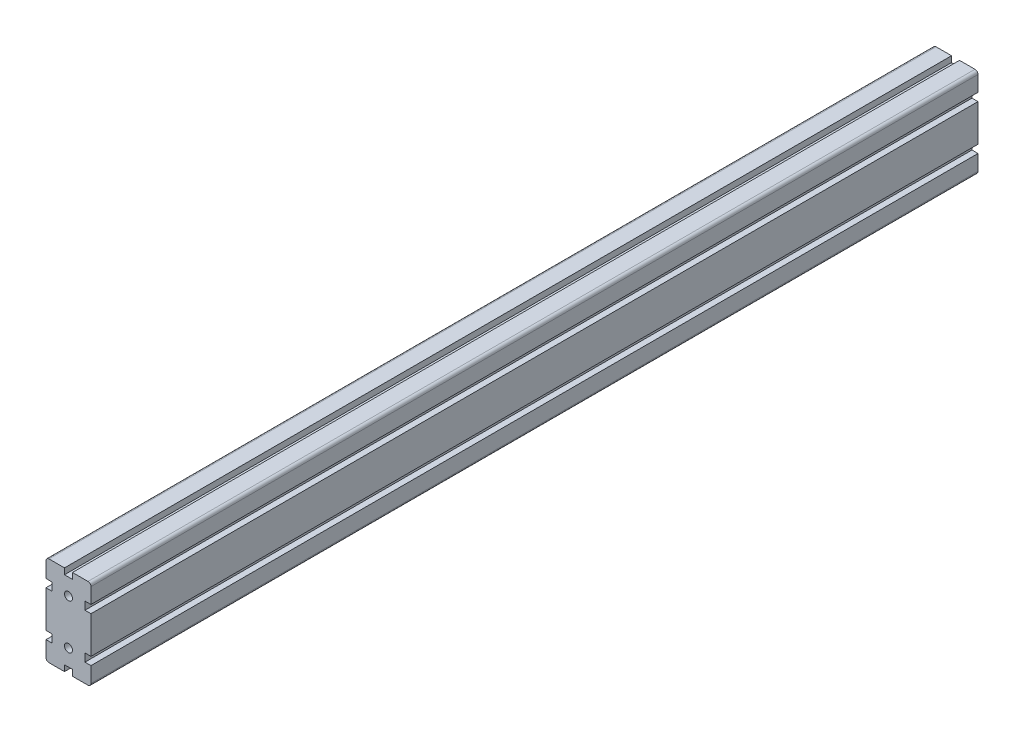
ISO-10303-21;
HEADER;
FILE_DESCRIPTION(('STEP AP214'),'2;1');
FILE_NAME('part.step','',(''),(''),'','','');
FILE_SCHEMA(('AUTOMOTIVE_DESIGN { 1 0 10303 214 1 1 1 1 }'));
ENDSEC;
DATA;
#1=APPLICATION_CONTEXT('core data for automotive mechanical design processes');
#2=APPLICATION_PROTOCOL_DEFINITION('international standard','automotive_design',2000,#1);
#3=PRODUCT_CONTEXT('',#1,'mechanical');
#4=PRODUCT('Part','Part','',(#3));
#5=PRODUCT_RELATED_PRODUCT_CATEGORY('part','',(#4));
#6=PRODUCT_DEFINITION_FORMATION('','',#4);
#7=PRODUCT_DEFINITION_CONTEXT('part definition',#1,'design');
#8=PRODUCT_DEFINITION('design','',#6,#7);
#9=PRODUCT_DEFINITION_SHAPE('','',#8);
#10=(LENGTH_UNIT() NAMED_UNIT(*) SI_UNIT(.MILLI.,.METRE.));
#11=(NAMED_UNIT(*) PLANE_ANGLE_UNIT() SI_UNIT($,.RADIAN.));
#12=(NAMED_UNIT(*) SI_UNIT($,.STERADIAN.) SOLID_ANGLE_UNIT());
#13=UNCERTAINTY_MEASURE_WITH_UNIT(LENGTH_MEASURE(1.E-05),#10,'distance_accuracy_value','');
#14=(GEOMETRIC_REPRESENTATION_CONTEXT(3) GLOBAL_UNCERTAINTY_ASSIGNED_CONTEXT((#13)) GLOBAL_UNIT_ASSIGNED_CONTEXT((#10,
#11,#12)) REPRESENTATION_CONTEXT('',''));
#15=CARTESIAN_POINT('',(0.,0.,0.));
#16=DIRECTION('',(0.,0.,1.));
#17=DIRECTION('',(1.,0.,0.));
#18=AXIS2_PLACEMENT_3D('',#15,#16,#17);
#19=CARTESIAN_POINT('',(-16.5000000000001,26.5,-112.));
#20=DIRECTION('',(-1.,0.,0.));
#21=DIRECTION('',(0.,0.,1.));
#22=AXIS2_PLACEMENT_3D('',#19,#20,#21);
#23=PLANE('',#22);
#24=DIRECTION('',(0.,1.,0.));
#25=VECTOR('',#24,1.);
#26=CARTESIAN_POINT('',(-16.5000000000001,26.5,-1000.));
#27=LINE('',#26,#25);
#28=CARTESIAN_POINT('',(-16.5000000000001,18.5,-1000.));
#29=VERTEX_POINT('',#28);
#30=CARTESIAN_POINT('',(-16.5000000000001,26.5,-1000.));
#31=VERTEX_POINT('',#30);
#32=EDGE_CURVE('E274',#29,#31,#27,.T.);
#33=ORIENTED_EDGE('',*,*,#32,.F.);
#34=DIRECTION('',(0.,0.,-1.));
#35=VECTOR('',#34,1.);
#36=CARTESIAN_POINT('',(-16.5000000000001,18.5,-112.));
#37=LINE('',#36,#35);
#38=CARTESIAN_POINT('',(-16.5000000000001,18.5,-112.));
#39=VERTEX_POINT('',#38);
#40=EDGE_CURVE('E11',#39,#29,#37,.T.);
#41=ORIENTED_EDGE('',*,*,#40,.F.);
#42=DIRECTION('',(0.,1.,0.));
#43=VECTOR('',#42,1.);
#44=CARTESIAN_POINT('',(-16.5000000000001,26.5,-112.));
#45=LINE('',#44,#43);
#46=CARTESIAN_POINT('',(-16.5000000000001,26.5,-112.));
#47=VERTEX_POINT('',#46);
#48=EDGE_CURVE('E367',#39,#47,#45,.T.);
#49=ORIENTED_EDGE('',*,*,#48,.T.);
#50=DIRECTION('',(0.,0.,-1.));
#51=VECTOR('',#50,1.);
#52=CARTESIAN_POINT('',(-16.5000000000001,26.5,-112.));
#53=LINE('',#52,#51);
#54=EDGE_CURVE('E36',#47,#31,#53,.T.);
#55=ORIENTED_EDGE('',*,*,#54,.T.);
#56=EDGE_LOOP('',(#33,#41,#49,#55));
#57=FACE_BOUND('',#56,.T.);
#58=ADVANCED_FACE('F33',(#57),#23,.T.);
#59=CARTESIAN_POINT('',(-22.4999999999999,18.5,-112.));
#60=DIRECTION('',(0.,1.,0.));
#61=DIRECTION('',(0.,0.,1.));
#62=AXIS2_PLACEMENT_3D('',#59,#60,#61);
#63=PLANE('',#62);
#64=DIRECTION('',(1.,0.,0.));
#65=VECTOR('',#64,1.);
#66=CARTESIAN_POINT('',(-22.4999999999999,18.5,-1000.));
#67=LINE('',#66,#65);
#68=CARTESIAN_POINT('',(-22.4999999999999,18.5,-1000.));
#69=VERTEX_POINT('',#68);
#70=EDGE_CURVE('E365',#69,#29,#67,.T.);
#71=ORIENTED_EDGE('',*,*,#70,.F.);
#72=DIRECTION('',(0.,0.,-1.));
#73=VECTOR('',#72,1.);
#74=CARTESIAN_POINT('',(-22.4999999999999,18.5,-112.));
#75=LINE('',#74,#73);
#76=CARTESIAN_POINT('',(-22.4999999999999,18.5,-112.));
#77=VERTEX_POINT('',#76);
#78=EDGE_CURVE('E42',#77,#69,#75,.T.);
#79=ORIENTED_EDGE('',*,*,#78,.F.);
#80=DIRECTION('',(1.,0.,0.));
#81=VECTOR('',#80,1.);
#82=CARTESIAN_POINT('',(-22.4999999999999,18.5,-112.));
#83=LINE('',#82,#81);
#84=EDGE_CURVE('E264',#77,#39,#83,.T.);
#85=ORIENTED_EDGE('',*,*,#84,.T.);
#86=ORIENTED_EDGE('',*,*,#40,.T.);
#87=EDGE_LOOP('',(#71,#79,#85,#86));
#88=FACE_BOUND('',#87,.T.);
#89=ADVANCED_FACE('F427',(#88),#63,.T.);
#90=CARTESIAN_POINT('',(-22.4999999999999,-18.5,-112.));
#91=DIRECTION('',(-1.,0.,0.));
#92=DIRECTION('',(0.,0.,1.));
#93=AXIS2_PLACEMENT_3D('',#90,#91,#92);
#94=PLANE('',#93);
#95=DIRECTION('',(0.,1.,0.));
#96=VECTOR('',#95,1.);
#97=CARTESIAN_POINT('',(-22.4999999999999,-18.5,-1000.));
#98=LINE('',#97,#96);
#99=CARTESIAN_POINT('',(-22.4999999999999,-18.5,-1000.));
#100=VERTEX_POINT('',#99);
#101=EDGE_CURVE('E251',#100,#69,#98,.T.);
#102=ORIENTED_EDGE('',*,*,#101,.F.);
#103=DIRECTION('',(0.,0.,-1.));
#104=VECTOR('',#103,1.);
#105=CARTESIAN_POINT('',(-22.4999999999999,-18.5,-112.));
#106=LINE('',#105,#104);
#107=CARTESIAN_POINT('',(-22.4999999999999,-18.5,-112.));
#108=VERTEX_POINT('',#107);
#109=EDGE_CURVE('E246',#108,#100,#106,.T.);
#110=ORIENTED_EDGE('',*,*,#109,.F.);
#111=DIRECTION('',(0.,1.,0.));
#112=VECTOR('',#111,1.);
#113=CARTESIAN_POINT('',(-22.4999999999999,-18.5,-112.));
#114=LINE('',#113,#112);
#115=EDGE_CURVE('E249',#108,#77,#114,.T.);
#116=ORIENTED_EDGE('',*,*,#115,.T.);
#117=ORIENTED_EDGE('',*,*,#78,.T.);
#118=EDGE_LOOP('',(#102,#110,#116,#117));
#119=FACE_BOUND('',#118,.T.);
#120=ADVANCED_FACE('F248',(#119),#94,.T.);
#121=CARTESIAN_POINT('',(-16.5000000000011,-18.5,-112.));
#122=DIRECTION('',(0.,-1.,0.));
#123=DIRECTION('',(0.,0.,-1.));
#124=AXIS2_PLACEMENT_3D('',#121,#122,#123);
#125=PLANE('',#124);
#126=DIRECTION('',(-1.,0.,0.));
#127=VECTOR('',#126,1.);
#128=CARTESIAN_POINT('',(-16.5000000000011,-18.5,-1000.));
#129=LINE('',#128,#127);
#130=CARTESIAN_POINT('',(-16.5000000000011,-18.5,-1000.));
#131=VERTEX_POINT('',#130);
#132=EDGE_CURVE('E362',#131,#100,#129,.T.);
#133=ORIENTED_EDGE('',*,*,#132,.F.);
#134=DIRECTION('',(0.,0.,-1.));
#135=VECTOR('',#134,1.);
#136=CARTESIAN_POINT('',(-16.5000000000011,-18.5,-112.));
#137=LINE('',#136,#135);
#138=CARTESIAN_POINT('',(-16.5000000000011,-18.5,-112.));
#139=VERTEX_POINT('',#138);
#140=EDGE_CURVE('E256',#139,#131,#137,.T.);
#141=ORIENTED_EDGE('',*,*,#140,.F.);
#142=DIRECTION('',(-1.,0.,0.));
#143=VECTOR('',#142,1.);
#144=CARTESIAN_POINT('',(-16.5000000000011,-18.5,-112.));
#145=LINE('',#144,#143);
#146=EDGE_CURVE('E262',#139,#108,#145,.T.);
#147=ORIENTED_EDGE('',*,*,#146,.T.);
#148=ORIENTED_EDGE('',*,*,#109,.T.);
#149=EDGE_LOOP('',(#133,#141,#147,#148));
#150=FACE_BOUND('',#149,.T.);
#151=ADVANCED_FACE('F266',(#150),#125,.T.);
#152=CARTESIAN_POINT('',(-16.5000000000011,-18.5,-112.));
#153=DIRECTION('',(-1.,0.,0.));
#154=DIRECTION('',(0.,0.,1.));
#155=AXIS2_PLACEMENT_3D('',#152,#153,#154);
#156=PLANE('',#155);
#157=DIRECTION('',(0.,1.,0.));
#158=VECTOR('',#157,1.);
#159=CARTESIAN_POINT('',(-16.5000000000011,-18.5,-1000.));
#160=LINE('',#159,#158);
#161=CARTESIAN_POINT('',(-16.5000000000011,-26.5,-1000.));
#162=VERTEX_POINT('',#161);
#163=EDGE_CURVE('E359',#162,#131,#160,.T.);
#164=ORIENTED_EDGE('',*,*,#163,.F.);
#165=DIRECTION('',(0.,0.,-1.));
#166=VECTOR('',#165,1.);
#167=CARTESIAN_POINT('',(-16.5000000000011,-26.5,-112.));
#168=LINE('',#167,#166);
#169=CARTESIAN_POINT('',(-16.5000000000011,-26.5,-112.));
#170=VERTEX_POINT('',#169);
#171=EDGE_CURVE('E371',#170,#162,#168,.T.);
#172=ORIENTED_EDGE('',*,*,#171,.F.);
#173=DIRECTION('',(0.,1.,0.));
#174=VECTOR('',#173,1.);
#175=CARTESIAN_POINT('',(-16.5000000000011,-18.5,-112.));
#176=LINE('',#175,#174);
#177=EDGE_CURVE('E267',#170,#139,#176,.T.);
#178=ORIENTED_EDGE('',*,*,#177,.T.);
#179=ORIENTED_EDGE('',*,*,#140,.T.);
#180=EDGE_LOOP('',(#164,#172,#178,#179));
#181=FACE_BOUND('',#180,.T.);
#182=ADVANCED_FACE('F440',(#181),#156,.T.);
#183=CARTESIAN_POINT('',(-22.4999999999999,-26.5,-112.));
#184=DIRECTION('',(0.,1.,0.));
#185=DIRECTION('',(0.,0.,1.));
#186=AXIS2_PLACEMENT_3D('',#183,#184,#185);
#187=PLANE('',#186);
#188=DIRECTION('',(1.,0.,0.));
#189=VECTOR('',#188,1.);
#190=CARTESIAN_POINT('',(-22.4999999999999,-26.5,-1000.));
#191=LINE('',#190,#189);
#192=CARTESIAN_POINT('',(-22.4999999999999,-26.5,-1000.));
#193=VERTEX_POINT('',#192);
#194=EDGE_CURVE('E356',#193,#162,#191,.T.);
#195=ORIENTED_EDGE('',*,*,#194,.F.);
#196=DIRECTION('',(0.,0.,-1.));
#197=VECTOR('',#196,1.);
#198=CARTESIAN_POINT('',(-22.4999999999999,-26.5,-112.));
#199=LINE('',#198,#197);
#200=CARTESIAN_POINT('',(-22.4999999999999,-26.5,-112.));
#201=VERTEX_POINT('',#200);
#202=EDGE_CURVE('E373',#201,#193,#199,.T.);
#203=ORIENTED_EDGE('',*,*,#202,.F.);
#204=DIRECTION('',(1.,0.,0.));
#205=VECTOR('',#204,1.);
#206=CARTESIAN_POINT('',(-22.4999999999999,-26.5,-112.));
#207=LINE('',#206,#205);
#208=EDGE_CURVE('E269',#201,#170,#207,.T.);
#209=ORIENTED_EDGE('',*,*,#208,.T.);
#210=ORIENTED_EDGE('',*,*,#171,.T.);
#211=EDGE_LOOP('',(#195,#203,#209,#210));
#212=FACE_BOUND('',#211,.T.);
#213=ADVANCED_FACE('F443',(#212),#187,.T.);
#214=CARTESIAN_POINT('',(-22.4999999999999,-42.,-112.));
#215=DIRECTION('',(-1.,0.,0.));
#216=DIRECTION('',(0.,0.,1.));
#217=AXIS2_PLACEMENT_3D('',#214,#215,#216);
#218=PLANE('',#217);
#219=DIRECTION('',(0.,1.,0.));
#220=VECTOR('',#219,1.);
#221=CARTESIAN_POINT('',(-22.4999999999999,-42.,-1000.));
#222=LINE('',#221,#220);
#223=CARTESIAN_POINT('',(-22.4999999999999,-42.,-1000.));
#224=VERTEX_POINT('',#223);
#225=EDGE_CURVE('E353',#224,#193,#222,.T.);
#226=ORIENTED_EDGE('',*,*,#225,.F.);
#227=DIRECTION('',(0.,0.,-1.));
#228=VECTOR('',#227,1.);
#229=CARTESIAN_POINT('',(-22.4999999999999,-42.,-112.));
#230=LINE('',#229,#228);
#231=CARTESIAN_POINT('',(-22.4999999999999,-42.,-112.));
#232=VERTEX_POINT('',#231);
#233=EDGE_CURVE('E375',#232,#224,#230,.T.);
#234=ORIENTED_EDGE('',*,*,#233,.F.);
#235=DIRECTION('',(0.,1.,0.));
#236=VECTOR('',#235,1.);
#237=CARTESIAN_POINT('',(-22.4999999999999,-42.,-112.));
#238=LINE('',#237,#236);
#239=EDGE_CURVE('E657',#232,#201,#238,.T.);
#240=ORIENTED_EDGE('',*,*,#239,.T.);
#241=ORIENTED_EDGE('',*,*,#202,.T.);
#242=EDGE_LOOP('',(#226,#234,#240,#241));
#243=FACE_BOUND('',#242,.T.);
#244=ADVANCED_FACE('F447',(#243),#218,.T.);
#245=CARTESIAN_POINT('',(-19.4999999999999,-42.,-112.));
#246=DIRECTION('',(0.,0.,-1.));
#247=DIRECTION('',(-1.,0.,0.));
#248=AXIS2_PLACEMENT_3D('',#245,#246,#247);
#249=CYLINDRICAL_SURFACE('',#248,3.00000000000001);
#250=CARTESIAN_POINT('',(-19.4999999999999,-42.,-1000.));
#251=DIRECTION('',(0.,0.,-1.));
#252=DIRECTION('',(-1.,0.,0.));
#253=AXIS2_PLACEMENT_3D('',#250,#251,#252);
#254=CIRCLE('',#253,3.00000000000001);
#255=CARTESIAN_POINT('',(-19.4999999999999,-45.,-1000.));
#256=VERTEX_POINT('',#255);
#257=EDGE_CURVE('E350',#256,#224,#254,.T.);
#258=ORIENTED_EDGE('',*,*,#257,.F.);
#259=DIRECTION('',(0.,0.,-1.));
#260=VECTOR('',#259,1.);
#261=CARTESIAN_POINT('',(-19.4999999999999,-45.,-112.));
#262=LINE('',#261,#260);
#263=CARTESIAN_POINT('',(-19.4999999999999,-45.,-112.));
#264=VERTEX_POINT('',#263);
#265=EDGE_CURVE('E377',#264,#256,#262,.T.);
#266=ORIENTED_EDGE('',*,*,#265,.F.);
#267=CARTESIAN_POINT('',(-19.4999999999999,-42.,-112.));
#268=DIRECTION('',(0.,0.,-1.));
#269=DIRECTION('',(-1.,0.,0.));
#270=AXIS2_PLACEMENT_3D('',#267,#268,#269);
#271=CIRCLE('',#270,3.00000000000001);
#272=EDGE_CURVE('E654',#264,#232,#271,.T.);
#273=ORIENTED_EDGE('',*,*,#272,.T.);
#274=ORIENTED_EDGE('',*,*,#233,.T.);
#275=EDGE_LOOP('',(#258,#266,#273,#274));
#276=FACE_BOUND('',#275,.T.);
#277=ADVANCED_FACE('F451',(#276),#249,.T.);
#278=CARTESIAN_POINT('',(-4.00000000000009,-45.,-112.));
#279=DIRECTION('',(0.,-1.,0.));
#280=DIRECTION('',(1.,0.,0.));
#281=AXIS2_PLACEMENT_3D('',#278,#279,#280);
#282=PLANE('',#281);
#283=DIRECTION('',(-1.,0.,0.));
#284=VECTOR('',#283,1.);
#285=CARTESIAN_POINT('',(-4.00000000000009,-45.,-1000.));
#286=LINE('',#285,#284);
#287=CARTESIAN_POINT('',(-4.00000000000009,-45.,-1000.));
#288=VERTEX_POINT('',#287);
#289=EDGE_CURVE('E347',#288,#256,#286,.T.);
#290=ORIENTED_EDGE('',*,*,#289,.F.);
#291=DIRECTION('',(0.,0.,-1.));
#292=VECTOR('',#291,1.);
#293=CARTESIAN_POINT('',(-4.00000000000009,-45.,-112.));
#294=LINE('',#293,#292);
#295=CARTESIAN_POINT('',(-4.00000000000009,-45.,-112.));
#296=VERTEX_POINT('',#295);
#297=EDGE_CURVE('E379',#296,#288,#294,.T.);
#298=ORIENTED_EDGE('',*,*,#297,.F.);
#299=DIRECTION('',(-1.,0.,0.));
#300=VECTOR('',#299,1.);
#301=CARTESIAN_POINT('',(-4.00000000000009,-45.,-112.));
#302=LINE('',#301,#300);
#303=EDGE_CURVE('E651',#296,#264,#302,.T.);
#304=ORIENTED_EDGE('',*,*,#303,.T.);
#305=ORIENTED_EDGE('',*,*,#265,.T.);
#306=EDGE_LOOP('',(#290,#298,#304,#305));
#307=FACE_BOUND('',#306,.T.);
#308=ADVANCED_FACE('F455',(#307),#282,.T.);
#309=CARTESIAN_POINT('',(-4.00000000000009,-39.,-112.));
#310=DIRECTION('',(1.,0.,0.));
#311=DIRECTION('',(0.,0.,-1.));
#312=AXIS2_PLACEMENT_3D('',#309,#310,#311);
#313=PLANE('',#312);
#314=DIRECTION('',(0.,-1.,0.));
#315=VECTOR('',#314,1.);
#316=CARTESIAN_POINT('',(-4.00000000000009,-39.,-1000.));
#317=LINE('',#316,#315);
#318=CARTESIAN_POINT('',(-4.00000000000009,-39.,-1000.));
#319=VERTEX_POINT('',#318);
#320=EDGE_CURVE('E344',#319,#288,#317,.T.);
#321=ORIENTED_EDGE('',*,*,#320,.F.);
#322=DIRECTION('',(0.,0.,-1.));
#323=VECTOR('',#322,1.);
#324=CARTESIAN_POINT('',(-4.00000000000009,-39.,-112.));
#325=LINE('',#324,#323);
#326=CARTESIAN_POINT('',(-4.00000000000009,-39.,-112.));
#327=VERTEX_POINT('',#326);
#328=EDGE_CURVE('E381',#327,#319,#325,.T.);
#329=ORIENTED_EDGE('',*,*,#328,.F.);
#330=DIRECTION('',(0.,-1.,0.));
#331=VECTOR('',#330,1.);
#332=CARTESIAN_POINT('',(-4.00000000000009,-39.,-112.));
#333=LINE('',#332,#331);
#334=EDGE_CURVE('E648',#327,#296,#333,.T.);
#335=ORIENTED_EDGE('',*,*,#334,.T.);
#336=ORIENTED_EDGE('',*,*,#297,.T.);
#337=EDGE_LOOP('',(#321,#329,#335,#336));
#338=FACE_BOUND('',#337,.T.);
#339=ADVANCED_FACE('F459',(#338),#313,.T.);
#340=CARTESIAN_POINT('',(3.99999999999992,-39.,-112.));
#341=DIRECTION('',(0.,-1.,0.));
#342=DIRECTION('',(0.,0.,-1.));
#343=AXIS2_PLACEMENT_3D('',#340,#341,#342);
#344=PLANE('',#343);
#345=DIRECTION('',(-1.,0.,0.));
#346=VECTOR('',#345,1.);
#347=CARTESIAN_POINT('',(3.99999999999992,-39.,-1000.));
#348=LINE('',#347,#346);
#349=CARTESIAN_POINT('',(3.99999999999992,-39.,-1000.));
#350=VERTEX_POINT('',#349);
#351=EDGE_CURVE('E341',#350,#319,#348,.T.);
#352=ORIENTED_EDGE('',*,*,#351,.F.);
#353=DIRECTION('',(0.,0.,-1.));
#354=VECTOR('',#353,1.);
#355=CARTESIAN_POINT('',(3.99999999999992,-39.,-112.));
#356=LINE('',#355,#354);
#357=CARTESIAN_POINT('',(3.99999999999992,-39.,-112.));
#358=VERTEX_POINT('',#357);
#359=EDGE_CURVE('E383',#358,#350,#356,.T.);
#360=ORIENTED_EDGE('',*,*,#359,.F.);
#361=DIRECTION('',(-1.,0.,0.));
#362=VECTOR('',#361,1.);
#363=CARTESIAN_POINT('',(3.99999999999992,-39.,-112.));
#364=LINE('',#363,#362);
#365=EDGE_CURVE('E645',#358,#327,#364,.T.);
#366=ORIENTED_EDGE('',*,*,#365,.T.);
#367=ORIENTED_EDGE('',*,*,#328,.T.);
#368=EDGE_LOOP('',(#352,#360,#366,#367));
#369=FACE_BOUND('',#368,.T.);
#370=ADVANCED_FACE('F463',(#369),#344,.T.);
#371=CARTESIAN_POINT('',(3.99999999999992,-45.,-112.));
#372=DIRECTION('',(-1.,0.,0.));
#373=DIRECTION('',(0.,0.,1.));
#374=AXIS2_PLACEMENT_3D('',#371,#372,#373);
#375=PLANE('',#374);
#376=DIRECTION('',(0.,1.,0.));
#377=VECTOR('',#376,1.);
#378=CARTESIAN_POINT('',(3.99999999999992,-45.,-1000.));
#379=LINE('',#378,#377);
#380=CARTESIAN_POINT('',(3.99999999999992,-45.,-1000.));
#381=VERTEX_POINT('',#380);
#382=EDGE_CURVE('E338',#381,#350,#379,.T.);
#383=ORIENTED_EDGE('',*,*,#382,.F.);
#384=DIRECTION('',(0.,0.,-1.));
#385=VECTOR('',#384,1.);
#386=CARTESIAN_POINT('',(3.99999999999992,-45.,-112.));
#387=LINE('',#386,#385);
#388=CARTESIAN_POINT('',(3.99999999999992,-45.,-112.));
#389=VERTEX_POINT('',#388);
#390=EDGE_CURVE('E385',#389,#381,#387,.T.);
#391=ORIENTED_EDGE('',*,*,#390,.F.);
#392=DIRECTION('',(0.,1.,0.));
#393=VECTOR('',#392,1.);
#394=CARTESIAN_POINT('',(3.99999999999992,-45.,-112.));
#395=LINE('',#394,#393);
#396=EDGE_CURVE('E642',#389,#358,#395,.T.);
#397=ORIENTED_EDGE('',*,*,#396,.T.);
#398=ORIENTED_EDGE('',*,*,#359,.T.);
#399=EDGE_LOOP('',(#383,#391,#397,#398));
#400=FACE_BOUND('',#399,.T.);
#401=ADVANCED_FACE('F467',(#400),#375,.T.);
#402=CARTESIAN_POINT('',(19.5000000000002,-44.9999999999999,-112.));
#403=DIRECTION('',(0.,-1.,0.));
#404=DIRECTION('',(1.,0.,0.));
#405=AXIS2_PLACEMENT_3D('',#402,#403,#404);
#406=PLANE('',#405);
#407=DIRECTION('',(-1.,0.,0.));
#408=VECTOR('',#407,1.);
#409=CARTESIAN_POINT('',(19.5000000000002,-44.9999999999999,-1000.));
#410=LINE('',#409,#408);
#411=CARTESIAN_POINT('',(19.5000000000002,-44.9999999999999,-1000.));
#412=VERTEX_POINT('',#411);
#413=EDGE_CURVE('E335',#412,#381,#410,.T.);
#414=ORIENTED_EDGE('',*,*,#413,.F.);
#415=DIRECTION('',(0.,0.,-1.));
#416=VECTOR('',#415,1.);
#417=CARTESIAN_POINT('',(19.5000000000002,-44.9999999999999,-112.));
#418=LINE('',#417,#416);
#419=CARTESIAN_POINT('',(19.5000000000002,-44.9999999999999,-112.));
#420=VERTEX_POINT('',#419);
#421=EDGE_CURVE('E387',#420,#412,#418,.T.);
#422=ORIENTED_EDGE('',*,*,#421,.F.);
#423=DIRECTION('',(-1.,0.,0.));
#424=VECTOR('',#423,1.);
#425=CARTESIAN_POINT('',(19.5000000000002,-44.9999999999999,-112.));
#426=LINE('',#425,#424);
#427=EDGE_CURVE('E639',#420,#389,#426,.T.);
#428=ORIENTED_EDGE('',*,*,#427,.T.);
#429=ORIENTED_EDGE('',*,*,#390,.T.);
#430=EDGE_LOOP('',(#414,#422,#428,#429));
#431=FACE_BOUND('',#430,.T.);
#432=ADVANCED_FACE('F471',(#431),#406,.T.);
#433=CARTESIAN_POINT('',(19.5000000000002,-41.9999999999999,-112.));
#434=DIRECTION('',(0.,0.,-1.));
#435=DIRECTION('',(-1.,0.,0.));
#436=AXIS2_PLACEMENT_3D('',#433,#434,#435);
#437=CYLINDRICAL_SURFACE('',#436,3.);
#438=CARTESIAN_POINT('',(19.5000000000002,-41.9999999999999,-1000.));
#439=DIRECTION('',(0.,0.,-1.));
#440=DIRECTION('',(-1.,0.,0.));
#441=AXIS2_PLACEMENT_3D('',#438,#439,#440);
#442=CIRCLE('',#441,3.);
#443=CARTESIAN_POINT('',(22.5000000000001,-41.9999999999999,-1000.));
#444=VERTEX_POINT('',#443);
#445=EDGE_CURVE('E332',#444,#412,#442,.T.);
#446=ORIENTED_EDGE('',*,*,#445,.F.);
#447=DIRECTION('',(0.,0.,-1.));
#448=VECTOR('',#447,1.);
#449=CARTESIAN_POINT('',(22.5000000000001,-41.9999999999999,-112.));
#450=LINE('',#449,#448);
#451=CARTESIAN_POINT('',(22.5000000000001,-41.9999999999999,-112.));
#452=VERTEX_POINT('',#451);
#453=EDGE_CURVE('E389',#452,#444,#450,.T.);
#454=ORIENTED_EDGE('',*,*,#453,.F.);
#455=CARTESIAN_POINT('',(19.5000000000002,-41.9999999999999,-112.));
#456=DIRECTION('',(0.,0.,-1.));
#457=DIRECTION('',(-1.,0.,0.));
#458=AXIS2_PLACEMENT_3D('',#455,#456,#457);
#459=CIRCLE('',#458,3.);
#460=EDGE_CURVE('E636',#452,#420,#459,.T.);
#461=ORIENTED_EDGE('',*,*,#460,.T.);
#462=ORIENTED_EDGE('',*,*,#421,.T.);
#463=EDGE_LOOP('',(#446,#454,#461,#462));
#464=FACE_BOUND('',#463,.T.);
#465=ADVANCED_FACE('F475',(#464),#437,.T.);
#466=CARTESIAN_POINT('',(22.4999999999999,-26.5,-112.));
#467=DIRECTION('',(1.,0.,0.));
#468=DIRECTION('',(0.,1.,0.));
#469=AXIS2_PLACEMENT_3D('',#466,#467,#468);
#470=PLANE('',#469);
#471=DIRECTION('',(0.,-1.,0.));
#472=VECTOR('',#471,1.);
#473=CARTESIAN_POINT('',(22.4999999999999,-26.5,-1000.));
#474=LINE('',#473,#472);
#475=CARTESIAN_POINT('',(22.4999999999999,-26.5,-1000.));
#476=VERTEX_POINT('',#475);
#477=EDGE_CURVE('E329',#476,#444,#474,.T.);
#478=ORIENTED_EDGE('',*,*,#477,.F.);
#479=DIRECTION('',(0.,0.,-1.));
#480=VECTOR('',#479,1.);
#481=CARTESIAN_POINT('',(22.4999999999999,-26.5,-112.));
#482=LINE('',#481,#480);
#483=CARTESIAN_POINT('',(22.4999999999999,-26.5,-112.));
#484=VERTEX_POINT('',#483);
#485=EDGE_CURVE('E391',#484,#476,#482,.T.);
#486=ORIENTED_EDGE('',*,*,#485,.F.);
#487=DIRECTION('',(0.,-1.,0.));
#488=VECTOR('',#487,1.);
#489=CARTESIAN_POINT('',(22.4999999999999,-26.5,-112.));
#490=LINE('',#489,#488);
#491=EDGE_CURVE('E633',#484,#452,#490,.T.);
#492=ORIENTED_EDGE('',*,*,#491,.T.);
#493=ORIENTED_EDGE('',*,*,#453,.T.);
#494=EDGE_LOOP('',(#478,#486,#492,#493));
#495=FACE_BOUND('',#494,.T.);
#496=ADVANCED_FACE('F479',(#495),#470,.T.);
#497=CARTESIAN_POINT('',(16.4999999999989,-26.5,-112.));
#498=DIRECTION('',(0.,1.,0.));
#499=DIRECTION('',(0.,0.,1.));
#500=AXIS2_PLACEMENT_3D('',#497,#498,#499);
#501=PLANE('',#500);
#502=DIRECTION('',(1.,0.,0.));
#503=VECTOR('',#502,1.);
#504=CARTESIAN_POINT('',(16.4999999999989,-26.5,-1000.));
#505=LINE('',#504,#503);
#506=CARTESIAN_POINT('',(16.4999999999989,-26.5,-1000.));
#507=VERTEX_POINT('',#506);
#508=EDGE_CURVE('E326',#507,#476,#505,.T.);
#509=ORIENTED_EDGE('',*,*,#508,.F.);
#510=DIRECTION('',(0.,0.,-1.));
#511=VECTOR('',#510,1.);
#512=CARTESIAN_POINT('',(16.4999999999989,-26.5,-112.));
#513=LINE('',#512,#511);
#514=CARTESIAN_POINT('',(16.4999999999989,-26.5,-112.));
#515=VERTEX_POINT('',#514);
#516=EDGE_CURVE('E393',#515,#507,#513,.T.);
#517=ORIENTED_EDGE('',*,*,#516,.F.);
#518=DIRECTION('',(1.,0.,0.));
#519=VECTOR('',#518,1.);
#520=CARTESIAN_POINT('',(16.4999999999989,-26.5,-112.));
#521=LINE('',#520,#519);
#522=EDGE_CURVE('E630',#515,#484,#521,.T.);
#523=ORIENTED_EDGE('',*,*,#522,.T.);
#524=ORIENTED_EDGE('',*,*,#485,.T.);
#525=EDGE_LOOP('',(#509,#517,#523,#524));
#526=FACE_BOUND('',#525,.T.);
#527=ADVANCED_FACE('F483',(#526),#501,.T.);
#528=CARTESIAN_POINT('',(16.4999999999989,-18.5,-112.));
#529=DIRECTION('',(1.,0.,0.));
#530=DIRECTION('',(0.,0.,-1.));
#531=AXIS2_PLACEMENT_3D('',#528,#529,#530);
#532=PLANE('',#531);
#533=DIRECTION('',(0.,-1.,0.));
#534=VECTOR('',#533,1.);
#535=CARTESIAN_POINT('',(16.4999999999989,-18.5,-1000.));
#536=LINE('',#535,#534);
#537=CARTESIAN_POINT('',(16.4999999999989,-18.5,-1000.));
#538=VERTEX_POINT('',#537);
#539=EDGE_CURVE('E323',#538,#507,#536,.T.);
#540=ORIENTED_EDGE('',*,*,#539,.F.);
#541=DIRECTION('',(0.,0.,-1.));
#542=VECTOR('',#541,1.);
#543=CARTESIAN_POINT('',(16.4999999999989,-18.5,-112.));
#544=LINE('',#543,#542);
#545=CARTESIAN_POINT('',(16.4999999999989,-18.5,-112.));
#546=VERTEX_POINT('',#545);
#547=EDGE_CURVE('E395',#546,#538,#544,.T.);
#548=ORIENTED_EDGE('',*,*,#547,.F.);
#549=DIRECTION('',(0.,-1.,0.));
#550=VECTOR('',#549,1.);
#551=CARTESIAN_POINT('',(16.4999999999989,-18.5,-112.));
#552=LINE('',#551,#550);
#553=EDGE_CURVE('E627',#546,#515,#552,.T.);
#554=ORIENTED_EDGE('',*,*,#553,.T.);
#555=ORIENTED_EDGE('',*,*,#516,.T.);
#556=EDGE_LOOP('',(#540,#548,#554,#555));
#557=FACE_BOUND('',#556,.T.);
#558=ADVANCED_FACE('F487',(#557),#532,.T.);
#559=CARTESIAN_POINT('',(22.4999999999999,-18.5,-112.));
#560=DIRECTION('',(0.,-1.,0.));
#561=DIRECTION('',(0.,0.,-1.));
#562=AXIS2_PLACEMENT_3D('',#559,#560,#561);
#563=PLANE('',#562);
#564=DIRECTION('',(-1.,0.,0.));
#565=VECTOR('',#564,1.);
#566=CARTESIAN_POINT('',(22.4999999999999,-18.5,-1000.));
#567=LINE('',#566,#565);
#568=CARTESIAN_POINT('',(22.4999999999999,-18.5,-1000.));
#569=VERTEX_POINT('',#568);
#570=EDGE_CURVE('E320',#569,#538,#567,.T.);
#571=ORIENTED_EDGE('',*,*,#570,.F.);
#572=DIRECTION('',(0.,0.,-1.));
#573=VECTOR('',#572,1.);
#574=CARTESIAN_POINT('',(22.4999999999999,-18.5,-112.));
#575=LINE('',#574,#573);
#576=CARTESIAN_POINT('',(22.4999999999999,-18.5,-112.));
#577=VERTEX_POINT('',#576);
#578=EDGE_CURVE('E397',#577,#569,#575,.T.);
#579=ORIENTED_EDGE('',*,*,#578,.F.);
#580=DIRECTION('',(-1.,0.,0.));
#581=VECTOR('',#580,1.);
#582=CARTESIAN_POINT('',(22.4999999999999,-18.5,-112.));
#583=LINE('',#582,#581);
#584=EDGE_CURVE('E624',#577,#546,#583,.T.);
#585=ORIENTED_EDGE('',*,*,#584,.T.);
#586=ORIENTED_EDGE('',*,*,#547,.T.);
#587=EDGE_LOOP('',(#571,#579,#585,#586));
#588=FACE_BOUND('',#587,.T.);
#589=ADVANCED_FACE('F491',(#588),#563,.T.);
#590=CARTESIAN_POINT('',(22.4999999999999,18.5,-112.));
#591=DIRECTION('',(1.,0.,0.));
#592=DIRECTION('',(0.,1.,0.));
#593=AXIS2_PLACEMENT_3D('',#590,#591,#592);
#594=PLANE('',#593);
#595=DIRECTION('',(0.,-1.,0.));
#596=VECTOR('',#595,1.);
#597=CARTESIAN_POINT('',(22.4999999999999,18.5,-1000.));
#598=LINE('',#597,#596);
#599=CARTESIAN_POINT('',(22.4999999999999,18.5,-1000.));
#600=VERTEX_POINT('',#599);
#601=EDGE_CURVE('E317',#600,#569,#598,.T.);
#602=ORIENTED_EDGE('',*,*,#601,.F.);
#603=DIRECTION('',(0.,0.,-1.));
#604=VECTOR('',#603,1.);
#605=CARTESIAN_POINT('',(22.4999999999999,18.5,-112.));
#606=LINE('',#605,#604);
#607=CARTESIAN_POINT('',(22.4999999999999,18.5,-112.));
#608=VERTEX_POINT('',#607);
#609=EDGE_CURVE('E399',#608,#600,#606,.T.);
#610=ORIENTED_EDGE('',*,*,#609,.F.);
#611=DIRECTION('',(0.,-1.,0.));
#612=VECTOR('',#611,1.);
#613=CARTESIAN_POINT('',(22.4999999999999,18.5,-112.));
#614=LINE('',#613,#612);
#615=EDGE_CURVE('E621',#608,#577,#614,.T.);
#616=ORIENTED_EDGE('',*,*,#615,.T.);
#617=ORIENTED_EDGE('',*,*,#578,.T.);
#618=EDGE_LOOP('',(#602,#610,#616,#617));
#619=FACE_BOUND('',#618,.T.);
#620=ADVANCED_FACE('F495',(#619),#594,.T.);
#621=CARTESIAN_POINT('',(16.4999999999999,18.5,-112.));
#622=DIRECTION('',(0.,1.,0.));
#623=DIRECTION('',(0.,0.,1.));
#624=AXIS2_PLACEMENT_3D('',#621,#622,#623);
#625=PLANE('',#624);
#626=DIRECTION('',(1.,0.,0.));
#627=VECTOR('',#626,1.);
#628=CARTESIAN_POINT('',(16.4999999999999,18.5,-1000.));
#629=LINE('',#628,#627);
#630=CARTESIAN_POINT('',(16.4999999999999,18.5,-1000.));
#631=VERTEX_POINT('',#630);
#632=EDGE_CURVE('E314',#631,#600,#629,.T.);
#633=ORIENTED_EDGE('',*,*,#632,.F.);
#634=DIRECTION('',(0.,0.,-1.));
#635=VECTOR('',#634,1.);
#636=CARTESIAN_POINT('',(16.4999999999999,18.5,-112.));
#637=LINE('',#636,#635);
#638=CARTESIAN_POINT('',(16.4999999999999,18.5,-112.));
#639=VERTEX_POINT('',#638);
#640=EDGE_CURVE('E401',#639,#631,#637,.T.);
#641=ORIENTED_EDGE('',*,*,#640,.F.);
#642=DIRECTION('',(1.,0.,0.));
#643=VECTOR('',#642,1.);
#644=CARTESIAN_POINT('',(16.4999999999999,18.5,-112.));
#645=LINE('',#644,#643);
#646=EDGE_CURVE('E618',#639,#608,#645,.T.);
#647=ORIENTED_EDGE('',*,*,#646,.T.);
#648=ORIENTED_EDGE('',*,*,#609,.T.);
#649=EDGE_LOOP('',(#633,#641,#647,#648));
#650=FACE_BOUND('',#649,.T.);
#651=ADVANCED_FACE('F499',(#650),#625,.T.);
#652=CARTESIAN_POINT('',(16.4999999999999,26.5,-112.));
#653=DIRECTION('',(1.,0.,0.));
#654=DIRECTION('',(0.,0.,-1.));
#655=AXIS2_PLACEMENT_3D('',#652,#653,#654);
#656=PLANE('',#655);
#657=DIRECTION('',(0.,-1.,0.));
#658=VECTOR('',#657,1.);
#659=CARTESIAN_POINT('',(16.4999999999999,26.5,-1000.));
#660=LINE('',#659,#658);
#661=CARTESIAN_POINT('',(16.4999999999999,26.5,-1000.));
#662=VERTEX_POINT('',#661);
#663=EDGE_CURVE('E311',#662,#631,#660,.T.);
#664=ORIENTED_EDGE('',*,*,#663,.F.);
#665=DIRECTION('',(0.,0.,-1.));
#666=VECTOR('',#665,1.);
#667=CARTESIAN_POINT('',(16.4999999999999,26.5,-112.));
#668=LINE('',#667,#666);
#669=CARTESIAN_POINT('',(16.4999999999999,26.5,-112.));
#670=VERTEX_POINT('',#669);
#671=EDGE_CURVE('E403',#670,#662,#668,.T.);
#672=ORIENTED_EDGE('',*,*,#671,.F.);
#673=DIRECTION('',(0.,-1.,0.));
#674=VECTOR('',#673,1.);
#675=CARTESIAN_POINT('',(16.4999999999999,26.5,-112.));
#676=LINE('',#675,#674);
#677=EDGE_CURVE('E615',#670,#639,#676,.T.);
#678=ORIENTED_EDGE('',*,*,#677,.T.);
#679=ORIENTED_EDGE('',*,*,#640,.T.);
#680=EDGE_LOOP('',(#664,#672,#678,#679));
#681=FACE_BOUND('',#680,.T.);
#682=ADVANCED_FACE('F503',(#681),#656,.T.);
#683=CARTESIAN_POINT('',(22.4999999999999,26.5,-112.));
#684=DIRECTION('',(0.,-1.,0.));
#685=DIRECTION('',(0.,0.,-1.));
#686=AXIS2_PLACEMENT_3D('',#683,#684,#685);
#687=PLANE('',#686);
#688=DIRECTION('',(-1.,0.,0.));
#689=VECTOR('',#688,1.);
#690=CARTESIAN_POINT('',(22.4999999999999,26.5,-1000.));
#691=LINE('',#690,#689);
#692=CARTESIAN_POINT('',(22.4999999999999,26.5,-1000.));
#693=VERTEX_POINT('',#692);
#694=EDGE_CURVE('E308',#693,#662,#691,.T.);
#695=ORIENTED_EDGE('',*,*,#694,.F.);
#696=DIRECTION('',(0.,0.,-1.));
#697=VECTOR('',#696,1.);
#698=CARTESIAN_POINT('',(22.4999999999999,26.5,-112.));
#699=LINE('',#698,#697);
#700=CARTESIAN_POINT('',(22.4999999999999,26.5,-112.));
#701=VERTEX_POINT('',#700);
#702=EDGE_CURVE('E405',#701,#693,#699,.T.);
#703=ORIENTED_EDGE('',*,*,#702,.F.);
#704=DIRECTION('',(-1.,0.,0.));
#705=VECTOR('',#704,1.);
#706=CARTESIAN_POINT('',(22.4999999999999,26.5,-112.));
#707=LINE('',#706,#705);
#708=EDGE_CURVE('E612',#701,#670,#707,.T.);
#709=ORIENTED_EDGE('',*,*,#708,.T.);
#710=ORIENTED_EDGE('',*,*,#671,.T.);
#711=EDGE_LOOP('',(#695,#703,#709,#710));
#712=FACE_BOUND('',#711,.T.);
#713=ADVANCED_FACE('F507',(#712),#687,.T.);
#714=CARTESIAN_POINT('',(22.4999999999999,42.0000000000001,-112.));
#715=DIRECTION('',(1.,0.,0.));
#716=DIRECTION('',(0.,1.,0.));
#717=AXIS2_PLACEMENT_3D('',#714,#715,#716);
#718=PLANE('',#717);
#719=DIRECTION('',(0.,-1.,0.));
#720=VECTOR('',#719,1.);
#721=CARTESIAN_POINT('',(22.4999999999999,42.0000000000001,-1000.));
#722=LINE('',#721,#720);
#723=CARTESIAN_POINT('',(22.4999999999998,42.0000000000001,-1000.));
#724=VERTEX_POINT('',#723);
#725=EDGE_CURVE('E305',#724,#693,#722,.T.);
#726=ORIENTED_EDGE('',*,*,#725,.F.);
#727=DIRECTION('',(0.,0.,-1.));
#728=VECTOR('',#727,1.);
#729=CARTESIAN_POINT('',(22.4999999999998,42.0000000000001,-112.));
#730=LINE('',#729,#728);
#731=CARTESIAN_POINT('',(22.4999999999998,42.0000000000001,-112.));
#732=VERTEX_POINT('',#731);
#733=EDGE_CURVE('E407',#732,#724,#730,.T.);
#734=ORIENTED_EDGE('',*,*,#733,.F.);
#735=DIRECTION('',(0.,-1.,0.));
#736=VECTOR('',#735,1.);
#737=CARTESIAN_POINT('',(22.4999999999999,42.0000000000001,-112.));
#738=LINE('',#737,#736);
#739=EDGE_CURVE('E609',#732,#701,#738,.T.);
#740=ORIENTED_EDGE('',*,*,#739,.T.);
#741=ORIENTED_EDGE('',*,*,#702,.T.);
#742=EDGE_LOOP('',(#726,#734,#740,#741));
#743=FACE_BOUND('',#742,.T.);
#744=ADVANCED_FACE('F511',(#743),#718,.T.);
#745=CARTESIAN_POINT('',(19.4999999999999,42.0000000000001,-112.));
#746=DIRECTION('',(0.,0.,-1.));
#747=DIRECTION('',(-1.,0.,0.));
#748=AXIS2_PLACEMENT_3D('',#745,#746,#747);
#749=CYLINDRICAL_SURFACE('',#748,2.99999999999998);
#750=CARTESIAN_POINT('',(19.4999999999999,42.0000000000001,-1000.));
#751=DIRECTION('',(0.,0.,-1.));
#752=DIRECTION('',(-1.,0.,0.));
#753=AXIS2_PLACEMENT_3D('',#750,#751,#752);
#754=CIRCLE('',#753,2.99999999999998);
#755=CARTESIAN_POINT('',(19.4999999999999,45.0000000000001,-1000.));
#756=VERTEX_POINT('',#755);
#757=EDGE_CURVE('E302',#756,#724,#754,.T.);
#758=ORIENTED_EDGE('',*,*,#757,.F.);
#759=DIRECTION('',(0.,0.,-1.));
#760=VECTOR('',#759,1.);
#761=CARTESIAN_POINT('',(19.4999999999999,45.0000000000001,-112.));
#762=LINE('',#761,#760);
#763=CARTESIAN_POINT('',(19.4999999999999,45.0000000000001,-112.));
#764=VERTEX_POINT('',#763);
#765=EDGE_CURVE('E409',#764,#756,#762,.T.);
#766=ORIENTED_EDGE('',*,*,#765,.F.);
#767=CARTESIAN_POINT('',(19.4999999999999,42.0000000000001,-112.));
#768=DIRECTION('',(0.,0.,-1.));
#769=DIRECTION('',(-1.,0.,0.));
#770=AXIS2_PLACEMENT_3D('',#767,#768,#769);
#771=CIRCLE('',#770,2.99999999999998);
#772=EDGE_CURVE('E606',#764,#732,#771,.T.);
#773=ORIENTED_EDGE('',*,*,#772,.T.);
#774=ORIENTED_EDGE('',*,*,#733,.T.);
#775=EDGE_LOOP('',(#758,#766,#773,#774));
#776=FACE_BOUND('',#775,.T.);
#777=ADVANCED_FACE('F515',(#776),#749,.T.);
#778=CARTESIAN_POINT('',(3.99999999999992,44.9999999999999,-112.));
#779=DIRECTION('',(0.,1.,0.));
#780=DIRECTION('',(-1.,0.,0.));
#781=AXIS2_PLACEMENT_3D('',#778,#779,#780);
#782=PLANE('',#781);
#783=DIRECTION('',(1.,0.,0.));
#784=VECTOR('',#783,1.);
#785=CARTESIAN_POINT('',(3.99999999999992,44.9999999999999,-1000.));
#786=LINE('',#785,#784);
#787=CARTESIAN_POINT('',(3.99999999999992,44.9999999999999,-1000.));
#788=VERTEX_POINT('',#787);
#789=EDGE_CURVE('E299',#788,#756,#786,.T.);
#790=ORIENTED_EDGE('',*,*,#789,.F.);
#791=DIRECTION('',(0.,0.,-1.));
#792=VECTOR('',#791,1.);
#793=CARTESIAN_POINT('',(3.99999999999992,44.9999999999999,-112.));
#794=LINE('',#793,#792);
#795=CARTESIAN_POINT('',(3.99999999999992,44.9999999999999,-112.));
#796=VERTEX_POINT('',#795);
#797=EDGE_CURVE('E411',#796,#788,#794,.T.);
#798=ORIENTED_EDGE('',*,*,#797,.F.);
#799=DIRECTION('',(1.,0.,0.));
#800=VECTOR('',#799,1.);
#801=CARTESIAN_POINT('',(3.99999999999992,44.9999999999999,-112.));
#802=LINE('',#801,#800);
#803=EDGE_CURVE('E603',#796,#764,#802,.T.);
#804=ORIENTED_EDGE('',*,*,#803,.T.);
#805=ORIENTED_EDGE('',*,*,#765,.T.);
#806=EDGE_LOOP('',(#790,#798,#804,#805));
#807=FACE_BOUND('',#806,.T.);
#808=ADVANCED_FACE('F519',(#807),#782,.T.);
#809=CARTESIAN_POINT('',(3.99999999999992,39.,-112.));
#810=DIRECTION('',(-1.,0.,0.));
#811=DIRECTION('',(0.,0.,1.));
#812=AXIS2_PLACEMENT_3D('',#809,#810,#811);
#813=PLANE('',#812);
#814=DIRECTION('',(0.,1.,0.));
#815=VECTOR('',#814,1.);
#816=CARTESIAN_POINT('',(3.99999999999992,39.,-1000.));
#817=LINE('',#816,#815);
#818=CARTESIAN_POINT('',(3.99999999999992,39.,-1000.));
#819=VERTEX_POINT('',#818);
#820=EDGE_CURVE('E296',#819,#788,#817,.T.);
#821=ORIENTED_EDGE('',*,*,#820,.F.);
#822=DIRECTION('',(0.,0.,-1.));
#823=VECTOR('',#822,1.);
#824=CARTESIAN_POINT('',(3.99999999999992,39.,-112.));
#825=LINE('',#824,#823);
#826=CARTESIAN_POINT('',(3.99999999999992,39.,-112.));
#827=VERTEX_POINT('',#826);
#828=EDGE_CURVE('E413',#827,#819,#825,.T.);
#829=ORIENTED_EDGE('',*,*,#828,.F.);
#830=DIRECTION('',(0.,1.,0.));
#831=VECTOR('',#830,1.);
#832=CARTESIAN_POINT('',(3.99999999999992,39.,-112.));
#833=LINE('',#832,#831);
#834=EDGE_CURVE('E600',#827,#796,#833,.T.);
#835=ORIENTED_EDGE('',*,*,#834,.T.);
#836=ORIENTED_EDGE('',*,*,#797,.T.);
#837=EDGE_LOOP('',(#821,#829,#835,#836));
#838=FACE_BOUND('',#837,.T.);
#839=ADVANCED_FACE('F523',(#838),#813,.T.);
#840=CARTESIAN_POINT('',(3.99999999999992,39.,-112.));
#841=DIRECTION('',(0.,1.,0.));
#842=DIRECTION('',(0.,0.,1.));
#843=AXIS2_PLACEMENT_3D('',#840,#841,#842);
#844=PLANE('',#843);
#845=DIRECTION('',(1.,0.,0.));
#846=VECTOR('',#845,1.);
#847=CARTESIAN_POINT('',(3.99999999999992,39.,-1000.));
#848=LINE('',#847,#846);
#849=CARTESIAN_POINT('',(-4.00000000000007,39.,-1000.));
#850=VERTEX_POINT('',#849);
#851=EDGE_CURVE('E293',#850,#819,#848,.T.);
#852=ORIENTED_EDGE('',*,*,#851,.F.);
#853=DIRECTION('',(0.,0.,-1.));
#854=VECTOR('',#853,1.);
#855=CARTESIAN_POINT('',(-4.00000000000007,39.,-112.));
#856=LINE('',#855,#854);
#857=CARTESIAN_POINT('',(-4.00000000000007,39.,-112.));
#858=VERTEX_POINT('',#857);
#859=EDGE_CURVE('E415',#858,#850,#856,.T.);
#860=ORIENTED_EDGE('',*,*,#859,.F.);
#861=DIRECTION('',(1.,0.,0.));
#862=VECTOR('',#861,1.);
#863=CARTESIAN_POINT('',(3.99999999999992,39.,-112.));
#864=LINE('',#863,#862);
#865=EDGE_CURVE('E597',#858,#827,#864,.T.);
#866=ORIENTED_EDGE('',*,*,#865,.T.);
#867=ORIENTED_EDGE('',*,*,#828,.T.);
#868=EDGE_LOOP('',(#852,#860,#866,#867));
#869=FACE_BOUND('',#868,.T.);
#870=ADVANCED_FACE('F527',(#869),#844,.T.);
#871=CARTESIAN_POINT('',(-4.00000000000007,44.9999999999999,-112.));
#872=DIRECTION('',(1.,0.,0.));
#873=DIRECTION('',(0.,0.,-1.));
#874=AXIS2_PLACEMENT_3D('',#871,#872,#873);
#875=PLANE('',#874);
#876=DIRECTION('',(0.,-1.,0.));
#877=VECTOR('',#876,1.);
#878=CARTESIAN_POINT('',(-4.00000000000007,44.9999999999999,-1000.));
#879=LINE('',#878,#877);
#880=CARTESIAN_POINT('',(-4.00000000000007,44.9999999999999,-1000.));
#881=VERTEX_POINT('',#880);
#882=EDGE_CURVE('E290',#881,#850,#879,.T.);
#883=ORIENTED_EDGE('',*,*,#882,.F.);
#884=DIRECTION('',(0.,0.,-1.));
#885=VECTOR('',#884,1.);
#886=CARTESIAN_POINT('',(-4.00000000000007,44.9999999999999,-112.));
#887=LINE('',#886,#885);
#888=CARTESIAN_POINT('',(-4.00000000000007,44.9999999999999,-112.));
#889=VERTEX_POINT('',#888);
#890=EDGE_CURVE('E417',#889,#881,#887,.T.);
#891=ORIENTED_EDGE('',*,*,#890,.F.);
#892=DIRECTION('',(0.,-1.,0.));
#893=VECTOR('',#892,1.);
#894=CARTESIAN_POINT('',(-4.00000000000007,44.9999999999999,-112.));
#895=LINE('',#894,#893);
#896=EDGE_CURVE('E594',#889,#858,#895,.T.);
#897=ORIENTED_EDGE('',*,*,#896,.T.);
#898=ORIENTED_EDGE('',*,*,#859,.T.);
#899=EDGE_LOOP('',(#883,#891,#897,#898));
#900=FACE_BOUND('',#899,.T.);
#901=ADVANCED_FACE('F531',(#900),#875,.T.);
#902=CARTESIAN_POINT('',(-19.5000000000002,44.9999999999999,-112.));
#903=DIRECTION('',(0.,1.,0.));
#904=DIRECTION('',(0.,0.,1.));
#905=AXIS2_PLACEMENT_3D('',#902,#903,#904);
#906=PLANE('',#905);
#907=DIRECTION('',(1.,0.,0.));
#908=VECTOR('',#907,1.);
#909=CARTESIAN_POINT('',(-19.5000000000002,44.9999999999999,-1000.));
#910=LINE('',#909,#908);
#911=CARTESIAN_POINT('',(-19.5000000000002,44.9999999999999,-1000.));
#912=VERTEX_POINT('',#911);
#913=EDGE_CURVE('E287',#912,#881,#910,.T.);
#914=ORIENTED_EDGE('',*,*,#913,.F.);
#915=DIRECTION('',(0.,0.,-1.));
#916=VECTOR('',#915,1.);
#917=CARTESIAN_POINT('',(-19.5000000000002,44.9999999999999,-112.));
#918=LINE('',#917,#916);
#919=CARTESIAN_POINT('',(-19.5000000000002,44.9999999999999,-112.));
#920=VERTEX_POINT('',#919);
#921=EDGE_CURVE('E419',#920,#912,#918,.T.);
#922=ORIENTED_EDGE('',*,*,#921,.F.);
#923=DIRECTION('',(1.,0.,0.));
#924=VECTOR('',#923,1.);
#925=CARTESIAN_POINT('',(-19.5000000000002,44.9999999999999,-112.));
#926=LINE('',#925,#924);
#927=EDGE_CURVE('E591',#920,#889,#926,.T.);
#928=ORIENTED_EDGE('',*,*,#927,.T.);
#929=ORIENTED_EDGE('',*,*,#890,.T.);
#930=EDGE_LOOP('',(#914,#922,#928,#929));
#931=FACE_BOUND('',#930,.T.);
#932=ADVANCED_FACE('F535',(#931),#906,.T.);
#933=CARTESIAN_POINT('',(-19.5000000000002,41.9999999999999,-112.));
#934=DIRECTION('',(0.,0.,-1.));
#935=DIRECTION('',(-1.,0.,0.));
#936=AXIS2_PLACEMENT_3D('',#933,#934,#935);
#937=CYLINDRICAL_SURFACE('',#936,2.99999999999998);
#938=CARTESIAN_POINT('',(-19.5000000000002,41.9999999999999,-1000.));
#939=DIRECTION('',(0.,0.,-1.));
#940=DIRECTION('',(-1.,0.,0.));
#941=AXIS2_PLACEMENT_3D('',#938,#939,#940);
#942=CIRCLE('',#941,2.99999999999998);
#943=CARTESIAN_POINT('',(-22.5000000000001,41.9999999999999,-1000.));
#944=VERTEX_POINT('',#943);
#945=EDGE_CURVE('E284',#944,#912,#942,.T.);
#946=ORIENTED_EDGE('',*,*,#945,.F.);
#947=DIRECTION('',(0.,0.,-1.));
#948=VECTOR('',#947,1.);
#949=CARTESIAN_POINT('',(-22.5000000000001,41.9999999999999,-112.));
#950=LINE('',#949,#948);
#951=CARTESIAN_POINT('',(-22.5000000000001,41.9999999999999,-112.));
#952=VERTEX_POINT('',#951);
#953=EDGE_CURVE('E421',#952,#944,#950,.T.);
#954=ORIENTED_EDGE('',*,*,#953,.F.);
#955=CARTESIAN_POINT('',(-19.5000000000002,41.9999999999999,-112.));
#956=DIRECTION('',(0.,0.,-1.));
#957=DIRECTION('',(-1.,0.,0.));
#958=AXIS2_PLACEMENT_3D('',#955,#956,#957);
#959=CIRCLE('',#958,2.99999999999998);
#960=EDGE_CURVE('E588',#952,#920,#959,.T.);
#961=ORIENTED_EDGE('',*,*,#960,.T.);
#962=ORIENTED_EDGE('',*,*,#921,.T.);
#963=EDGE_LOOP('',(#946,#954,#961,#962));
#964=FACE_BOUND('',#963,.T.);
#965=ADVANCED_FACE('F539',(#964),#937,.T.);
#966=CARTESIAN_POINT('',(-22.4999999999999,26.5,-112.));
#967=DIRECTION('',(-1.,0.,0.));
#968=DIRECTION('',(0.,-1.,0.));
#969=AXIS2_PLACEMENT_3D('',#966,#967,#968);
#970=PLANE('',#969);
#971=DIRECTION('',(0.,1.,0.));
#972=VECTOR('',#971,1.);
#973=CARTESIAN_POINT('',(-22.4999999999999,26.5,-1000.));
#974=LINE('',#973,#972);
#975=CARTESIAN_POINT('',(-22.4999999999999,26.5,-1000.));
#976=VERTEX_POINT('',#975);
#977=EDGE_CURVE('E281',#976,#944,#974,.T.);
#978=ORIENTED_EDGE('',*,*,#977,.F.);
#979=DIRECTION('',(0.,0.,-1.));
#980=VECTOR('',#979,1.);
#981=CARTESIAN_POINT('',(-22.4999999999999,26.5,-112.));
#982=LINE('',#981,#980);
#983=CARTESIAN_POINT('',(-22.4999999999999,26.5,-112.));
#984=VERTEX_POINT('',#983);
#985=EDGE_CURVE('E422',#984,#976,#982,.T.);
#986=ORIENTED_EDGE('',*,*,#985,.F.);
#987=DIRECTION('',(0.,1.,0.));
#988=VECTOR('',#987,1.);
#989=CARTESIAN_POINT('',(-22.4999999999999,26.5,-112.));
#990=LINE('',#989,#988);
#991=EDGE_CURVE('E585',#984,#952,#990,.T.);
#992=ORIENTED_EDGE('',*,*,#991,.T.);
#993=ORIENTED_EDGE('',*,*,#953,.T.);
#994=EDGE_LOOP('',(#978,#986,#992,#993));
#995=FACE_BOUND('',#994,.T.);
#996=ADVANCED_FACE('F543',(#995),#970,.T.);
#997=CARTESIAN_POINT('',(-16.5000000000001,26.5,-112.));
#998=DIRECTION('',(0.,-1.,0.));
#999=DIRECTION('',(0.,0.,-1.));
#1000=AXIS2_PLACEMENT_3D('',#997,#998,#999);
#1001=PLANE('',#1000);
#1002=DIRECTION('',(-1.,0.,0.));
#1003=VECTOR('',#1002,1.);
#1004=CARTESIAN_POINT('',(-16.5000000000001,26.5,-1000.));
#1005=LINE('',#1004,#1003);
#1006=EDGE_CURVE('E277',#31,#976,#1005,.T.);
#1007=ORIENTED_EDGE('',*,*,#1006,.F.);
#1008=ORIENTED_EDGE('',*,*,#54,.F.);
#1009=DIRECTION('',(-1.,0.,0.));
#1010=VECTOR('',#1009,1.);
#1011=CARTESIAN_POINT('',(-16.5000000000001,26.5,-112.));
#1012=LINE('',#1011,#1010);
#1013=EDGE_CURVE('E583',#47,#984,#1012,.T.);
#1014=ORIENTED_EDGE('',*,*,#1013,.T.);
#1015=ORIENTED_EDGE('',*,*,#985,.T.);
#1016=EDGE_LOOP('',(#1007,#1008,#1014,#1015));
#1017=FACE_BOUND('',#1016,.T.);
#1018=ADVANCED_FACE('F424',(#1017),#1001,.T.);
#1019=CARTESIAN_POINT('',(-19.4999999999999,-42.,-112.));
#1020=DIRECTION('',(0.,0.,-1.));
#1021=DIRECTION('',(-1.,0.,0.));
#1022=AXIS2_PLACEMENT_3D('',#1019,#1020,#1021);
#1023=PLANE('',#1022);
#1024=CARTESIAN_POINT('',(0.,-22.5,-112.));
#1025=DIRECTION('',(0.,0.,-1.));
#1026=DIRECTION('',(1.,0.,0.));
#1027=AXIS2_PLACEMENT_3D('',#1024,#1025,#1026);
#1028=CIRCLE('',#1027,3.99999999999999);
#1029=CARTESIAN_POINT('',(4.00000000000007,-22.5,-112.));
#1030=VERTEX_POINT('',#1029);
#1031=EDGE_CURVE('E570',#1030,#1030,#1028,.T.);
#1032=ORIENTED_EDGE('',*,*,#1031,.T.);
#1033=EDGE_LOOP('',(#1032));
#1034=FACE_BOUND('',#1033,.T.);
#1035=CARTESIAN_POINT('',(0.,22.5,-112.));
#1036=DIRECTION('',(0.,0.,-1.));
#1037=DIRECTION('',(1.,0.,0.));
#1038=AXIS2_PLACEMENT_3D('',#1035,#1036,#1037);
#1039=CIRCLE('',#1038,3.99999999999999);
#1040=CARTESIAN_POINT('',(3.99999999999991,22.5,-112.));
#1041=VERTEX_POINT('',#1040);
#1042=EDGE_CURVE('E278',#1041,#1041,#1039,.T.);
#1043=ORIENTED_EDGE('',*,*,#1042,.T.);
#1044=EDGE_LOOP('',(#1043));
#1045=FACE_BOUND('',#1044,.T.);
#1046=ORIENTED_EDGE('',*,*,#48,.F.);
#1047=ORIENTED_EDGE('',*,*,#84,.F.);
#1048=ORIENTED_EDGE('',*,*,#115,.F.);
#1049=ORIENTED_EDGE('',*,*,#146,.F.);
#1050=ORIENTED_EDGE('',*,*,#177,.F.);
#1051=ORIENTED_EDGE('',*,*,#208,.F.);
#1052=ORIENTED_EDGE('',*,*,#239,.F.);
#1053=ORIENTED_EDGE('',*,*,#272,.F.);
#1054=ORIENTED_EDGE('',*,*,#303,.F.);
#1055=ORIENTED_EDGE('',*,*,#334,.F.);
#1056=ORIENTED_EDGE('',*,*,#365,.F.);
#1057=ORIENTED_EDGE('',*,*,#396,.F.);
#1058=ORIENTED_EDGE('',*,*,#427,.F.);
#1059=ORIENTED_EDGE('',*,*,#460,.F.);
#1060=ORIENTED_EDGE('',*,*,#491,.F.);
#1061=ORIENTED_EDGE('',*,*,#522,.F.);
#1062=ORIENTED_EDGE('',*,*,#553,.F.);
#1063=ORIENTED_EDGE('',*,*,#584,.F.);
#1064=ORIENTED_EDGE('',*,*,#615,.F.);
#1065=ORIENTED_EDGE('',*,*,#646,.F.);
#1066=ORIENTED_EDGE('',*,*,#677,.F.);
#1067=ORIENTED_EDGE('',*,*,#708,.F.);
#1068=ORIENTED_EDGE('',*,*,#739,.F.);
#1069=ORIENTED_EDGE('',*,*,#772,.F.);
#1070=ORIENTED_EDGE('',*,*,#803,.F.);
#1071=ORIENTED_EDGE('',*,*,#834,.F.);
#1072=ORIENTED_EDGE('',*,*,#865,.F.);
#1073=ORIENTED_EDGE('',*,*,#896,.F.);
#1074=ORIENTED_EDGE('',*,*,#927,.F.);
#1075=ORIENTED_EDGE('',*,*,#960,.F.);
#1076=ORIENTED_EDGE('',*,*,#991,.F.);
#1077=ORIENTED_EDGE('',*,*,#1013,.F.);
#1078=EDGE_LOOP('',(#1046,#1047,#1048,#1049,#1050,#1051,#1052,#1053,#1054,#1055,#1056,#1057,
#1058,#1059,#1060,#1061,#1062,#1063,#1064,#1065,#1066,#1067,#1068,#1069,#1070,#1071,#1072,#1073,
#1074,#1075,#1076,#1077));
#1079=FACE_BOUND('',#1078,.T.);
#1080=ADVANCED_FACE('F260',(#1034,#1045,#1079),#1023,.F.);
#1081=CARTESIAN_POINT('',(-19.4999999999999,-42.,-1000.));
#1082=DIRECTION('',(0.,0.,-1.));
#1083=DIRECTION('',(-1.,0.,0.));
#1084=AXIS2_PLACEMENT_3D('',#1081,#1082,#1083);
#1085=PLANE('',#1084);
#1086=CARTESIAN_POINT('',(0.,-22.5,-1000.));
#1087=DIRECTION('',(0.,0.,-1.));
#1088=DIRECTION('',(1.,0.,0.));
#1089=AXIS2_PLACEMENT_3D('',#1086,#1087,#1088);
#1090=CIRCLE('',#1089,3.99999999999999);
#1091=CARTESIAN_POINT('',(4.00000000000007,-22.5,-1000.));
#1092=VERTEX_POINT('',#1091);
#1093=EDGE_CURVE('E573',#1092,#1092,#1090,.T.);
#1094=ORIENTED_EDGE('',*,*,#1093,.F.);
#1095=EDGE_LOOP('',(#1094));
#1096=FACE_BOUND('',#1095,.T.);
#1097=CARTESIAN_POINT('',(0.,22.5,-1000.));
#1098=DIRECTION('',(0.,0.,-1.));
#1099=DIRECTION('',(1.,0.,0.));
#1100=AXIS2_PLACEMENT_3D('',#1097,#1098,#1099);
#1101=CIRCLE('',#1100,3.99999999999999);
#1102=CARTESIAN_POINT('',(3.99999999999991,22.5,-1000.));
#1103=VERTEX_POINT('',#1102);
#1104=EDGE_CURVE('E575',#1103,#1103,#1101,.T.);
#1105=ORIENTED_EDGE('',*,*,#1104,.F.);
#1106=EDGE_LOOP('',(#1105));
#1107=FACE_BOUND('',#1106,.T.);
#1108=ORIENTED_EDGE('',*,*,#32,.T.);
#1109=ORIENTED_EDGE('',*,*,#1006,.T.);
#1110=ORIENTED_EDGE('',*,*,#977,.T.);
#1111=ORIENTED_EDGE('',*,*,#945,.T.);
#1112=ORIENTED_EDGE('',*,*,#913,.T.);
#1113=ORIENTED_EDGE('',*,*,#882,.T.);
#1114=ORIENTED_EDGE('',*,*,#851,.T.);
#1115=ORIENTED_EDGE('',*,*,#820,.T.);
#1116=ORIENTED_EDGE('',*,*,#789,.T.);
#1117=ORIENTED_EDGE('',*,*,#757,.T.);
#1118=ORIENTED_EDGE('',*,*,#725,.T.);
#1119=ORIENTED_EDGE('',*,*,#694,.T.);
#1120=ORIENTED_EDGE('',*,*,#663,.T.);
#1121=ORIENTED_EDGE('',*,*,#632,.T.);
#1122=ORIENTED_EDGE('',*,*,#601,.T.);
#1123=ORIENTED_EDGE('',*,*,#570,.T.);
#1124=ORIENTED_EDGE('',*,*,#539,.T.);
#1125=ORIENTED_EDGE('',*,*,#508,.T.);
#1126=ORIENTED_EDGE('',*,*,#477,.T.);
#1127=ORIENTED_EDGE('',*,*,#445,.T.);
#1128=ORIENTED_EDGE('',*,*,#413,.T.);
#1129=ORIENTED_EDGE('',*,*,#382,.T.);
#1130=ORIENTED_EDGE('',*,*,#351,.T.);
#1131=ORIENTED_EDGE('',*,*,#320,.T.);
#1132=ORIENTED_EDGE('',*,*,#289,.T.);
#1133=ORIENTED_EDGE('',*,*,#257,.T.);
#1134=ORIENTED_EDGE('',*,*,#225,.T.);
#1135=ORIENTED_EDGE('',*,*,#194,.T.);
#1136=ORIENTED_EDGE('',*,*,#163,.T.);
#1137=ORIENTED_EDGE('',*,*,#132,.T.);
#1138=ORIENTED_EDGE('',*,*,#101,.T.);
#1139=ORIENTED_EDGE('',*,*,#70,.T.);
#1140=EDGE_LOOP('',(#1108,#1109,#1110,#1111,#1112,#1113,#1114,#1115,#1116,#1117,#1118,#1119,
#1120,#1121,#1122,#1123,#1124,#1125,#1126,#1127,#1128,#1129,#1130,#1131,#1132,#1133,#1134,#1135,
#1136,#1137,#1138,#1139));
#1141=FACE_BOUND('',#1140,.T.);
#1142=ADVANCED_FACE('F426',(#1096,#1107,#1141),#1085,.T.);
#1143=CARTESIAN_POINT('',(0.,22.5,-112.));
#1144=DIRECTION('',(0.,0.,-1.));
#1145=DIRECTION('',(-1.,0.,0.));
#1146=AXIS2_PLACEMENT_3D('',#1143,#1144,#1145);
#1147=CYLINDRICAL_SURFACE('',#1146,3.99999999999999);
#1148=ORIENTED_EDGE('',*,*,#1042,.F.);
#1149=EDGE_LOOP('',(#1148));
#1150=FACE_BOUND('',#1149,.T.);
#1151=ORIENTED_EDGE('',*,*,#1104,.T.);
#1152=EDGE_LOOP('',(#1151));
#1153=FACE_BOUND('',#1152,.T.);
#1154=ADVANCED_FACE('F555',(#1150,#1153),#1147,.F.);
#1155=CARTESIAN_POINT('',(0.,-22.5,-112.));
#1156=DIRECTION('',(0.,0.,-1.));
#1157=DIRECTION('',(-1.,0.,0.));
#1158=AXIS2_PLACEMENT_3D('',#1155,#1156,#1157);
#1159=CYLINDRICAL_SURFACE('',#1158,3.99999999999999);
#1160=ORIENTED_EDGE('',*,*,#1031,.F.);
#1161=EDGE_LOOP('',(#1160));
#1162=FACE_BOUND('',#1161,.T.);
#1163=ORIENTED_EDGE('',*,*,#1093,.T.);
#1164=EDGE_LOOP('',(#1163));
#1165=FACE_BOUND('',#1164,.T.);
#1166=ADVANCED_FACE('F562',(#1162,#1165),#1159,.F.);
#1167=CLOSED_SHELL('',(#58,#89,#120,#151,#182,#213,#244,#277,#308,#339,#370,#401,#432,#465,#496,
#527,#558,#589,#620,#651,#682,#713,#744,#777,#808,#839,#870,#901,#932,#965,#996,#1018,#1080,
#1142,#1154,#1166));
#1168=MANIFOLD_SOLID_BREP('B2',#1167);
#1169=ADVANCED_BREP_SHAPE_REPRESENTATION('',(#18,#1168),#14);
#1170=SHAPE_DEFINITION_REPRESENTATION(#9,#1169);
ENDSEC;
END-ISO-10303-21;
